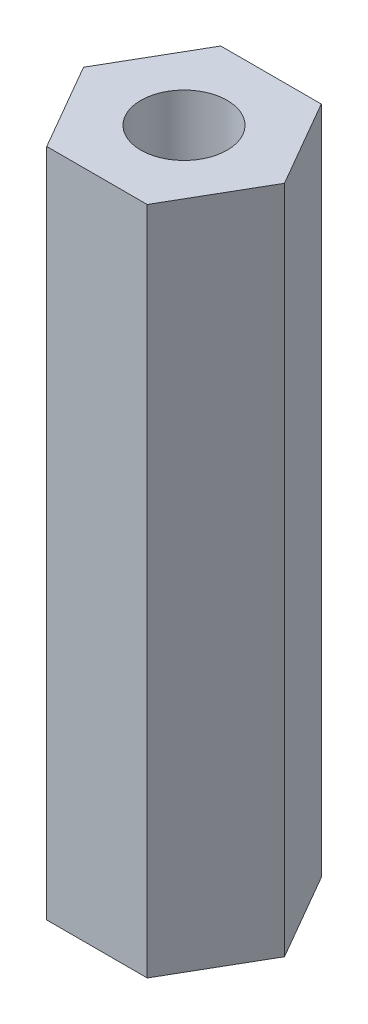
ISO-10303-21;
HEADER;
FILE_DESCRIPTION(('STEP AP214'),'2;1');
FILE_NAME('part.step','',(''),(''),'','','');
FILE_SCHEMA(('AUTOMOTIVE_DESIGN { 1 0 10303 214 1 1 1 1 }'));
ENDSEC;
DATA;
#1=APPLICATION_CONTEXT('core data for automotive mechanical design processes');
#2=APPLICATION_PROTOCOL_DEFINITION('international standard','automotive_design',2000,#1);
#3=PRODUCT_CONTEXT('',#1,'mechanical');
#4=PRODUCT('Part','Part','',(#3));
#5=PRODUCT_RELATED_PRODUCT_CATEGORY('part','',(#4));
#6=PRODUCT_DEFINITION_FORMATION('','',#4);
#7=PRODUCT_DEFINITION_CONTEXT('part definition',#1,'design');
#8=PRODUCT_DEFINITION('design','',#6,#7);
#9=PRODUCT_DEFINITION_SHAPE('','',#8);
#10=(LENGTH_UNIT() NAMED_UNIT(*) SI_UNIT(.MILLI.,.METRE.));
#11=(NAMED_UNIT(*) PLANE_ANGLE_UNIT() SI_UNIT($,.RADIAN.));
#12=(NAMED_UNIT(*) SI_UNIT($,.STERADIAN.) SOLID_ANGLE_UNIT());
#13=UNCERTAINTY_MEASURE_WITH_UNIT(LENGTH_MEASURE(1.E-05),#10,'distance_accuracy_value','');
#14=(GEOMETRIC_REPRESENTATION_CONTEXT(3) GLOBAL_UNCERTAINTY_ASSIGNED_CONTEXT((#13)) GLOBAL_UNIT_ASSIGNED_CONTEXT((#10,
#11,#12)) REPRESENTATION_CONTEXT('',''));
#15=CARTESIAN_POINT('',(0.,0.,0.));
#16=DIRECTION('',(0.,0.,1.));
#17=DIRECTION('',(1.,0.,0.));
#18=AXIS2_PLACEMENT_3D('',#15,#16,#17);
#19=CARTESIAN_POINT('',(1.50000000000003,30.,2.5980762113533));
#20=DIRECTION('',(-0.866025403784441,0.,-0.499999999999995));
#21=DIRECTION('',(-0.499999999999995,0.,0.866025403784442));
#22=AXIS2_PLACEMENT_3D('',#19,#20,#21);
#23=PLANE('',#22);
#24=DIRECTION('',(-0.499999999999995,0.,0.866025403784442));
#25=VECTOR('',#24,1.);
#26=CARTESIAN_POINT('',(1.50000000000003,5.,2.5980762113533));
#27=LINE('',#26,#25);
#28=CARTESIAN_POINT('',(3.,5.,0.));
#29=VERTEX_POINT('',#28);
#30=CARTESIAN_POINT('',(1.50000000000003,5.,2.5980762113533));
#31=VERTEX_POINT('',#30);
#32=EDGE_CURVE('E56',#29,#31,#27,.T.);
#33=ORIENTED_EDGE('',*,*,#32,.F.);
#34=DIRECTION('',(0.,-1.,0.));
#35=VECTOR('',#34,1.);
#36=CARTESIAN_POINT('',(3.,30.,0.));
#37=LINE('',#36,#35);
#38=CARTESIAN_POINT('',(3.,25.,0.));
#39=VERTEX_POINT('',#38);
#40=EDGE_CURVE('E11',#39,#29,#37,.T.);
#41=ORIENTED_EDGE('',*,*,#40,.F.);
#42=DIRECTION('',(0.499999999999995,0.,-0.866025403784442));
#43=VECTOR('',#42,1.);
#44=CARTESIAN_POINT('',(1.50000000000003,25.,2.5980762113533));
#45=LINE('',#44,#43);
#46=CARTESIAN_POINT('',(1.50000000000003,25.,2.5980762113533));
#47=VERTEX_POINT('',#46);
#48=EDGE_CURVE('E169',#47,#39,#45,.T.);
#49=ORIENTED_EDGE('',*,*,#48,.F.);
#50=DIRECTION('',(0.,-1.,0.));
#51=VECTOR('',#50,1.);
#52=CARTESIAN_POINT('',(1.50000000000003,30.,2.5980762113533));
#53=LINE('',#52,#51);
#54=EDGE_CURVE('E125',#47,#31,#53,.T.);
#55=ORIENTED_EDGE('',*,*,#54,.T.);
#56=EDGE_LOOP('',(#33,#41,#49,#55));
#57=FACE_BOUND('',#56,.T.);
#58=ADVANCED_FACE('F40',(#57),#23,.F.);
#59=CARTESIAN_POINT('',(3.,30.,0.));
#60=DIRECTION('',(-0.866025403784438,0.,0.500000000000001));
#61=DIRECTION('',(0.500000000000001,0.,0.866025403784438));
#62=AXIS2_PLACEMENT_3D('',#59,#60,#61);
#63=PLANE('',#62);
#64=DIRECTION('',(0.500000000000001,0.,0.866025403784438));
#65=VECTOR('',#64,1.);
#66=CARTESIAN_POINT('',(3.,5.,0.));
#67=LINE('',#66,#65);
#68=CARTESIAN_POINT('',(1.49999999999999,5.,-2.59807621135332));
#69=VERTEX_POINT('',#68);
#70=EDGE_CURVE('E95',#69,#29,#67,.T.);
#71=ORIENTED_EDGE('',*,*,#70,.F.);
#72=DIRECTION('',(0.,-1.,0.));
#73=VECTOR('',#72,1.);
#74=CARTESIAN_POINT('',(1.49999999999999,30.,-2.59807621135332));
#75=LINE('',#74,#73);
#76=CARTESIAN_POINT('',(1.49999999999999,25.,-2.59807621135332));
#77=VERTEX_POINT('',#76);
#78=EDGE_CURVE('E48',#77,#69,#75,.T.);
#79=ORIENTED_EDGE('',*,*,#78,.F.);
#80=DIRECTION('',(-0.500000000000001,0.,-0.866025403784438));
#81=VECTOR('',#80,1.);
#82=CARTESIAN_POINT('',(3.,25.,0.));
#83=LINE('',#82,#81);
#84=EDGE_CURVE('E167',#39,#77,#83,.T.);
#85=ORIENTED_EDGE('',*,*,#84,.F.);
#86=ORIENTED_EDGE('',*,*,#40,.T.);
#87=EDGE_LOOP('',(#71,#79,#85,#86));
#88=FACE_BOUND('',#87,.T.);
#89=ADVANCED_FACE('F105',(#88),#63,.F.);
#90=CARTESIAN_POINT('',(1.49999999999999,30.,-2.59807621135332));
#91=DIRECTION('',(0.,0.,1.));
#92=DIRECTION('',(1.,0.,0.));
#93=AXIS2_PLACEMENT_3D('',#90,#91,#92);
#94=PLANE('',#93);
#95=DIRECTION('',(1.,0.,0.));
#96=VECTOR('',#95,1.);
#97=CARTESIAN_POINT('',(1.49999999999999,5.,-2.59807621135332));
#98=LINE('',#97,#96);
#99=CARTESIAN_POINT('',(-1.50000000000001,5.,-2.59807621135331));
#100=VERTEX_POINT('',#99);
#101=EDGE_CURVE('E92',#100,#69,#98,.T.);
#102=ORIENTED_EDGE('',*,*,#101,.F.);
#103=DIRECTION('',(0.,-1.,0.));
#104=VECTOR('',#103,1.);
#105=CARTESIAN_POINT('',(-1.50000000000001,30.,-2.59807621135331));
#106=LINE('',#105,#104);
#107=CARTESIAN_POINT('',(-1.50000000000001,25.,-2.59807621135331));
#108=VERTEX_POINT('',#107);
#109=EDGE_CURVE('E112',#108,#100,#106,.T.);
#110=ORIENTED_EDGE('',*,*,#109,.F.);
#111=DIRECTION('',(-1.,0.,0.));
#112=VECTOR('',#111,1.);
#113=CARTESIAN_POINT('',(1.49999999999999,25.,-2.59807621135332));
#114=LINE('',#113,#112);
#115=EDGE_CURVE('E111',#77,#108,#114,.T.);
#116=ORIENTED_EDGE('',*,*,#115,.F.);
#117=ORIENTED_EDGE('',*,*,#78,.T.);
#118=EDGE_LOOP('',(#102,#110,#116,#117));
#119=FACE_BOUND('',#118,.T.);
#120=ADVANCED_FACE('F110',(#119),#94,.F.);
#121=CARTESIAN_POINT('',(-1.50000000000001,30.,-2.59807621135331));
#122=DIRECTION('',(0.866025403784441,0.,0.499999999999995));
#123=DIRECTION('',(0.499999999999995,0.,-0.866025403784442));
#124=AXIS2_PLACEMENT_3D('',#121,#122,#123);
#125=PLANE('',#124);
#126=DIRECTION('',(0.499999999999995,0.,-0.866025403784442));
#127=VECTOR('',#126,1.);
#128=CARTESIAN_POINT('',(-1.50000000000001,5.,-2.59807621135331));
#129=LINE('',#128,#127);
#130=CARTESIAN_POINT('',(-3.,5.,0.));
#131=VERTEX_POINT('',#130);
#132=EDGE_CURVE('E97',#131,#100,#129,.T.);
#133=ORIENTED_EDGE('',*,*,#132,.F.);
#134=DIRECTION('',(0.,-1.,0.));
#135=VECTOR('',#134,1.);
#136=CARTESIAN_POINT('',(-3.,30.,0.));
#137=LINE('',#136,#135);
#138=CARTESIAN_POINT('',(-3.,25.,0.));
#139=VERTEX_POINT('',#138);
#140=EDGE_CURVE('E114',#139,#131,#137,.T.);
#141=ORIENTED_EDGE('',*,*,#140,.F.);
#142=DIRECTION('',(-0.499999999999995,0.,0.866025403784442));
#143=VECTOR('',#142,1.);
#144=CARTESIAN_POINT('',(-1.50000000000001,25.,-2.59807621135331));
#145=LINE('',#144,#143);
#146=EDGE_CURVE('E164',#108,#139,#145,.T.);
#147=ORIENTED_EDGE('',*,*,#146,.F.);
#148=ORIENTED_EDGE('',*,*,#109,.T.);
#149=EDGE_LOOP('',(#133,#141,#147,#148));
#150=FACE_BOUND('',#149,.T.);
#151=ADVANCED_FACE('F185',(#150),#125,.F.);
#152=CARTESIAN_POINT('',(-3.,30.,0.));
#153=DIRECTION('',(0.866025403784435,0.,-0.500000000000007));
#154=DIRECTION('',(-0.500000000000007,0.,-0.866025403784435));
#155=AXIS2_PLACEMENT_3D('',#152,#153,#154);
#156=PLANE('',#155);
#157=DIRECTION('',(-0.500000000000007,0.,-0.866025403784435));
#158=VECTOR('',#157,1.);
#159=CARTESIAN_POINT('',(-3.,5.,0.));
#160=LINE('',#159,#158);
#161=CARTESIAN_POINT('',(-1.49999999999998,5.,2.59807621135333));
#162=VERTEX_POINT('',#161);
#163=EDGE_CURVE('E182',#162,#131,#160,.T.);
#164=ORIENTED_EDGE('',*,*,#163,.F.);
#165=DIRECTION('',(0.,-1.,0.));
#166=VECTOR('',#165,1.);
#167=CARTESIAN_POINT('',(-1.49999999999998,30.,2.59807621135333));
#168=LINE('',#167,#166);
#169=CARTESIAN_POINT('',(-1.49999999999998,25.,2.59807621135333));
#170=VERTEX_POINT('',#169);
#171=EDGE_CURVE('E174',#170,#162,#168,.T.);
#172=ORIENTED_EDGE('',*,*,#171,.F.);
#173=DIRECTION('',(0.500000000000007,0.,0.866025403784435));
#174=VECTOR('',#173,1.);
#175=CARTESIAN_POINT('',(-3.,25.,0.));
#176=LINE('',#175,#174);
#177=EDGE_CURVE('E64',#139,#170,#176,.T.);
#178=ORIENTED_EDGE('',*,*,#177,.F.);
#179=ORIENTED_EDGE('',*,*,#140,.T.);
#180=EDGE_LOOP('',(#164,#172,#178,#179));
#181=FACE_BOUND('',#180,.T.);
#182=ADVANCED_FACE('F180',(#181),#156,.F.);
#183=CARTESIAN_POINT('',(-1.49999999999998,30.,2.59807621135333));
#184=DIRECTION('',(0.,0.,-1.));
#185=DIRECTION('',(-1.,0.,0.));
#186=AXIS2_PLACEMENT_3D('',#183,#184,#185);
#187=PLANE('',#186);
#188=DIRECTION('',(-1.,0.,0.));
#189=VECTOR('',#188,1.);
#190=CARTESIAN_POINT('',(-1.49999999999998,5.,2.59807621135333));
#191=LINE('',#190,#189);
#192=EDGE_CURVE('E187',#31,#162,#191,.T.);
#193=ORIENTED_EDGE('',*,*,#192,.F.);
#194=ORIENTED_EDGE('',*,*,#54,.F.);
#195=DIRECTION('',(1.,0.,0.));
#196=VECTOR('',#195,1.);
#197=CARTESIAN_POINT('',(-1.49999999999998,25.,2.59807621135333));
#198=LINE('',#197,#196);
#199=EDGE_CURVE('E160',#170,#47,#198,.T.);
#200=ORIENTED_EDGE('',*,*,#199,.F.);
#201=ORIENTED_EDGE('',*,*,#171,.T.);
#202=EDGE_LOOP('',(#193,#194,#200,#201));
#203=FACE_BOUND('',#202,.T.);
#204=ADVANCED_FACE('F140',(#203),#187,.F.);
#205=CARTESIAN_POINT('',(-0.0145163390681466,0.,-0.0251430368059477));
#206=DIRECTION('',(0.,-1.,0.));
#207=DIRECTION('',(0.,0.,-1.));
#208=AXIS2_PLACEMENT_3D('',#205,#206,#207);
#209=CYLINDRICAL_SURFACE('',#208,1.64999999999999);
#210=CARTESIAN_POINT('',(-0.0145163390681466,15.,-0.0251430368059477));
#211=DIRECTION('',(0.,-1.,0.));
#212=DIRECTION('',(0.,0.,-1.));
#213=AXIS2_PLACEMENT_3D('',#210,#211,#212);
#214=CIRCLE('',#213,1.65);
#215=CARTESIAN_POINT('',(-0.0145163390681466,15.,-1.67514303680594));
#216=VERTEX_POINT('',#215);
#217=EDGE_CURVE('E126',#216,#216,#214,.T.);
#218=ORIENTED_EDGE('',*,*,#217,.F.);
#219=EDGE_LOOP('',(#218));
#220=FACE_BOUND('',#219,.T.);
#221=CARTESIAN_POINT('',(-0.0145163390681466,5.,-0.0251430368059477));
#222=DIRECTION('',(0.,-1.,0.));
#223=DIRECTION('',(0.,0.,-1.));
#224=AXIS2_PLACEMENT_3D('',#221,#222,#223);
#225=CIRCLE('',#224,1.64999999999999);
#226=CARTESIAN_POINT('',(-0.0145163390681466,5.,-1.67514303680594));
#227=VERTEX_POINT('',#226);
#228=EDGE_CURVE('E43',#227,#227,#225,.F.);
#229=ORIENTED_EDGE('',*,*,#228,.F.);
#230=EDGE_LOOP('',(#229));
#231=FACE_BOUND('',#230,.T.);
#232=ADVANCED_FACE('F137',(#220,#231),#209,.F.);
#233=CARTESIAN_POINT('',(0.,30.,0.));
#234=DIRECTION('',(0.,1.,0.));
#235=DIRECTION('',(0.,0.,1.));
#236=AXIS2_PLACEMENT_3D('',#233,#234,#235);
#237=CYLINDRICAL_SURFACE('',#236,1.28905);
#238=CARTESIAN_POINT('',(-1.04889699982457,15.2327253620546,-0.74930967314363));
#239=CARTESIAN_POINT('',(-1.00680893587414,15.2331394619791,-0.808219770462514));
#240=CARTESIAN_POINT('',(-0.959715437868597,15.2334773134153,-0.863619126183125));
#241=CARTESIAN_POINT('',(-0.856855808728744,15.2339896706447,-0.965771082940333));
#242=CARTESIAN_POINT('',(-0.801079307332683,15.2341639793436,-1.01251319638325));
#243=CARTESIAN_POINT('',(-0.682491247304899,15.2343434528329,-1.09595023059796));
#244=CARTESIAN_POINT('',(-0.619683082007376,15.2343486988592,-1.13264996841134));
#245=CARTESIAN_POINT('',(-0.488814322065833,15.2341900471674,-1.19497395204033));
#246=CARTESIAN_POINT('',(-0.420755035887587,15.2340261914606,-1.220600946507));
#247=CARTESIAN_POINT('',(-0.281294793453927,15.2335343747676,-1.26006945624929));
#248=CARTESIAN_POINT('',(-0.209893552898761,15.2332063997967,-1.27390996692043));
#249=CARTESIAN_POINT('',(-0.0657790538411845,15.232396250792,-1.28940901906405));
#250=CARTESIAN_POINT('',(0.00693425618150251,15.2319140706907,-1.2910670811273));
#251=CARTESIAN_POINT('',(0.151608091366927,15.2308100352528,-1.28215345626076));
#252=CARTESIAN_POINT('',(0.223568598001561,15.2301881764869,-1.27158146903448));
#253=CARTESIAN_POINT('',(0.364692467825354,15.2288234067686,-1.23850787766857));
#254=CARTESIAN_POINT('',(0.433855835413933,15.2280804960066,-1.21600629229292));
#255=CARTESIAN_POINT('',(0.567428699377976,15.2264956057307,-1.15971020813924));
#256=CARTESIAN_POINT('',(0.631837780740873,15.2256536175847,-1.12591472491084));
#257=CARTESIAN_POINT('',(0.754067428840539,15.223895385298,-1.04799105962883));
#258=CARTESIAN_POINT('',(0.811888004117073,15.2229791412535,-1.00386289096828));
#259=CARTESIAN_POINT('',(0.919304770234205,15.2210989721165,-0.906522197979566));
#260=CARTESIAN_POINT('',(0.968900233727494,15.2201350428169,-0.853308871093659));
#261=CARTESIAN_POINT('',(1.05845304623758,15.2181873173187,-0.739311073593347));
#262=CARTESIAN_POINT('',(1.09841038166278,15.2172035210921,-0.678526592302354));
#263=CARTESIAN_POINT('',(1.16755452727489,15.215244003154,-0.551108573702783));
#264=CARTESIAN_POINT('',(1.19674078637817,15.2142682818583,-0.484474737337842));
#265=CARTESIAN_POINT('',(1.24351123943355,15.2123524158591,-0.347252177293248));
#266=CARTESIAN_POINT('',(1.26109543743883,15.2114122711432,-0.27666345499524));
#267=CARTESIAN_POINT('',(1.28416222235073,15.2095937252142,-0.133535344713847));
#268=CARTESIAN_POINT('',(1.289644884538,15.2087153236171,-0.060995968867831));
#269=CARTESIAN_POINT('',(1.28835270956047,15.2070444512803,0.083974541985059));
#270=CARTESIAN_POINT('',(1.28157787394795,15.2062519805298,0.15640567700564));
#271=CARTESIAN_POINT('',(1.25596328927503,15.2047746385586,0.299098938742039));
#272=CARTESIAN_POINT('',(1.23712425858928,15.2040897609342,0.369361194344859));
#273=CARTESIAN_POINT('',(1.18791627737354,15.2028460832819,0.505726234965582));
#274=CARTESIAN_POINT('',(1.15754733255872,15.2022872831914,0.57182902204524));
#275=CARTESIAN_POINT('',(1.08614440785046,15.201310822698,0.697992612696334));
#276=CARTESIAN_POINT('',(1.04511134285756,15.2008931501945,0.758053933966838));
#277=CARTESIAN_POINT('',(0.953543550421125,15.2002100444224,0.870435620059578));
#278=CARTESIAN_POINT('',(0.903008826835465,15.1999446110921,0.922755988024788));
#279=CARTESIAN_POINT('',(0.793876439035575,15.1995730673411,1.01816647423358));
#280=CARTESIAN_POINT('',(0.735279382820714,15.1994669449136,1.06125728787354));
#281=CARTESIAN_POINT('',(0.611682878622889,15.1994168053407,1.13699025875234));
#282=CARTESIAN_POINT('',(0.546683433171244,15.1994727881312,1.16963242012226));
#283=CARTESIAN_POINT('',(0.412129739344977,15.1997453667093,1.22354055946264));
#284=CARTESIAN_POINT('',(0.342575645687322,15.1999619570438,1.24480692363309));
#285=CARTESIAN_POINT('',(0.200885110333232,15.200549981485,1.2753617248239));
#286=CARTESIAN_POINT('',(0.128748667513839,15.200921415659,1.28465015663547));
#287=CARTESIAN_POINT('',(-0.0160604783261969,15.2018092231757,1.29098587782673));
#288=CARTESIAN_POINT('',(-0.0887331930629429,15.2023255996942,1.28803289896932));
#289=CARTESIAN_POINT('',(-0.232550505105209,15.2034894377501,1.26996952387773));
#290=CARTESIAN_POINT('',(-0.30369510354419,15.2041368991901,1.25485913666146));
#291=CARTESIAN_POINT('',(-0.442441867689742,15.2055454788311,1.21290892986785));
#292=CARTESIAN_POINT('',(-0.510043792839369,15.2063066047368,1.18606831492959));
#293=CARTESIAN_POINT('',(-0.639781587192279,15.207921775338,1.12141975772324));
#294=CARTESIAN_POINT('',(-0.701917443968714,15.2087758202449,1.08361179052224));
#295=CARTESIAN_POINT('',(-0.818964704106253,15.2105534586719,0.998098348210923));
#296=CARTESIAN_POINT('',(-0.873875494638786,15.2114770580813,0.950392034408203));
#297=CARTESIAN_POINT('',(-0.974908190806287,15.2133681310571,0.846438089569057));
#298=CARTESIAN_POINT('',(-1.02103007500531,15.2143356047304,0.790190437701104));
#299=CARTESIAN_POINT('',(-1.10317952415233,15.2162873894139,0.670745286035637));
#300=CARTESIAN_POINT('',(-1.13920620961135,15.2172717018831,0.607547181385383));
#301=CARTESIAN_POINT('',(-1.20013595202562,15.2192291355948,0.47600155346804));
#302=CARTESIAN_POINT('',(-1.22503944334787,15.2202022572727,0.407654231402623));
#303=CARTESIAN_POINT('',(-1.26301655005115,15.2221093558034,0.267754521650379));
#304=CARTESIAN_POINT('',(-1.27609116808284,15.2230433359675,0.196202406151104));
#305=CARTESIAN_POINT('',(-1.29004322062716,15.2248453975818,0.0518981963762453));
#306=CARTESIAN_POINT('',(-1.29091762423466,15.2257134626033,-0.0208541915894611));
#307=CARTESIAN_POINT('',(-1.28043844555008,15.2273582737651,-0.165499170282754));
#308=CARTESIAN_POINT('',(-1.26907950365289,15.2281349797143,-0.237391370191705));
#309=CARTESIAN_POINT('',(-1.23445089460829,15.2295729833483,-0.378185738093053));
#310=CARTESIAN_POINT('',(-1.21119557784224,15.230234418796,-0.447091400310913));
#311=CARTESIAN_POINT('',(-1.16432546181204,15.2311995812705,-0.555021805922608));
#312=CARTESIAN_POINT('',(-1.14411700292169,15.2315444248336,-0.595560497471325));
#313=CARTESIAN_POINT('',(-1.09955657205191,15.2321778964038,-0.674293233855689));
#314=CARTESIAN_POINT('',(-1.07520460009286,15.2324665244112,-0.712487278702868));
#315=CARTESIAN_POINT('',(-1.04889699982457,15.2327253620546,-0.74930967314363));
#316=B_SPLINE_CURVE_WITH_KNOTS('',3,(#238,#239,#240,#241,#242,#243,#244,#245,#246,#247,#248,
#249,#250,#251,#252,#253,#254,#255,#256,#257,#258,#259,#260,#261,#262,#263,#264,#265,#266,#267,
#268,#269,#270,#271,#272,#273,#274,#275,#276,#277,#278,#279,#280,#281,#282,#283,#284,#285,#286,
#287,#288,#289,#290,#291,#292,#293,#294,#295,#296,#297,#298,#299,#300,#301,#302,#303,#304,#305,
#306,#307,#308,#309,#310,#311,#312,#313,#314,#315),.UNSPECIFIED.,.T.,.F.,(4,2,2,2,2,2,2,2,2,2,2,
2,2,2,2,2,2,2,2,2,2,2,2,2,2,2,2,2,2,2,2,2,2,2,2,2,2,2,4),(0.,0.21703930095767,0.434339833020932,
0.651535948760402,0.868678117633983,1.08583879246543,1.30300801305624,1.52018256613058,
1.7373567776134,1.95454992436762,2.17174278960131,2.38895485098859,2.60616721868453,
2.82339069813804,3.04061410170467,3.25783615397505,3.47505817873681,3.69226726999703,
3.90947625359074,4.12666660845116,4.34385687512795,4.56103077194652,4.77820458290117,
4.99537102049587,5.21253755252864,5.42970884319839,5.64687997277861,5.86406582979956,
6.08125218056947,6.29845694118017,6.51566223154156,6.732886438847,6.950102162683,
7.16729947293954,7.38455074066768,7.60189722804357,7.81898215037213,7.95464491706317,
8.09030768308696),.UNSPECIFIED.);
#317=CARTESIAN_POINT('',(-1.04889699982457,15.2327253620546,-0.74930967314363));
#318=VERTEX_POINT('',#317);
#319=EDGE_CURVE('E118',#318,#318,#316,.T.);
#320=ORIENTED_EDGE('',*,*,#319,.T.);
#321=EDGE_LOOP('',(#320));
#322=FACE_BOUND('',#321,.T.);
#323=CARTESIAN_POINT('',(0.,25.,0.));
#324=DIRECTION('',(0.,1.,0.));
#325=DIRECTION('',(0.,0.,1.));
#326=AXIS2_PLACEMENT_3D('',#323,#324,#325);
#327=CIRCLE('',#326,1.28905);
#328=CARTESIAN_POINT('',(0.,25.,1.28905));
#329=VERTEX_POINT('',#328);
#330=EDGE_CURVE('E127',#329,#329,#327,.F.);
#331=ORIENTED_EDGE('',*,*,#330,.F.);
#332=EDGE_LOOP('',(#331));
#333=FACE_BOUND('',#332,.T.);
#334=ADVANCED_FACE('F128',(#322,#333),#237,.F.);
#335=CARTESIAN_POINT('',(-0.0145163390681466,15.,-0.0251430368059477));
#336=DIRECTION('',(0.,-1.,0.));
#337=DIRECTION('',(0.,0.,-1.));
#338=AXIS2_PLACEMENT_3D('',#335,#336,#337);
#339=CONICAL_SURFACE('',#338,1.65,1.02974425867665);
#340=ORIENTED_EDGE('',*,*,#217,.T.);
#341=EDGE_LOOP('',(#340));
#342=FACE_BOUND('',#341,.T.);
#343=ORIENTED_EDGE('',*,*,#319,.F.);
#344=EDGE_LOOP('',(#343));
#345=FACE_BOUND('',#344,.T.);
#346=ADVANCED_FACE('F131',(#342,#345),#339,.F.);
#347=CARTESIAN_POINT('',(0.,25.,0.));
#348=DIRECTION('',(0.,1.,0.));
#349=DIRECTION('',(0.,0.,1.));
#350=AXIS2_PLACEMENT_3D('',#347,#348,#349);
#351=PLANE('',#350);
#352=ORIENTED_EDGE('',*,*,#330,.T.);
#353=EDGE_LOOP('',(#352));
#354=FACE_BOUND('',#353,.T.);
#355=ORIENTED_EDGE('',*,*,#48,.T.);
#356=ORIENTED_EDGE('',*,*,#84,.T.);
#357=ORIENTED_EDGE('',*,*,#115,.T.);
#358=ORIENTED_EDGE('',*,*,#146,.T.);
#359=ORIENTED_EDGE('',*,*,#177,.T.);
#360=ORIENTED_EDGE('',*,*,#199,.T.);
#361=EDGE_LOOP('',(#355,#356,#357,#358,#359,#360));
#362=FACE_BOUND('',#361,.T.);
#363=ADVANCED_FACE('F135',(#354,#362),#351,.T.);
#364=CARTESIAN_POINT('',(0.,5.,0.));
#365=DIRECTION('',(0.,-1.,0.));
#366=DIRECTION('',(0.,0.,-1.));
#367=AXIS2_PLACEMENT_3D('',#364,#365,#366);
#368=PLANE('',#367);
#369=ORIENTED_EDGE('',*,*,#228,.T.);
#370=EDGE_LOOP('',(#369));
#371=FACE_BOUND('',#370,.T.);
#372=ORIENTED_EDGE('',*,*,#32,.T.);
#373=ORIENTED_EDGE('',*,*,#192,.T.);
#374=ORIENTED_EDGE('',*,*,#163,.T.);
#375=ORIENTED_EDGE('',*,*,#132,.T.);
#376=ORIENTED_EDGE('',*,*,#101,.T.);
#377=ORIENTED_EDGE('',*,*,#70,.T.);
#378=EDGE_LOOP('',(#372,#373,#374,#375,#376,#377));
#379=FACE_BOUND('',#378,.T.);
#380=ADVANCED_FACE('F94',(#371,#379),#368,.T.);
#381=CLOSED_SHELL('',(#58,#89,#120,#151,#182,#204,#232,#334,#346,#363,#380));
#382=MANIFOLD_SOLID_BREP('B2',#381);
#383=ADVANCED_BREP_SHAPE_REPRESENTATION('',(#18,#382),#14);
#384=SHAPE_DEFINITION_REPRESENTATION(#9,#383);
ENDSEC;
END-ISO-10303-21;
